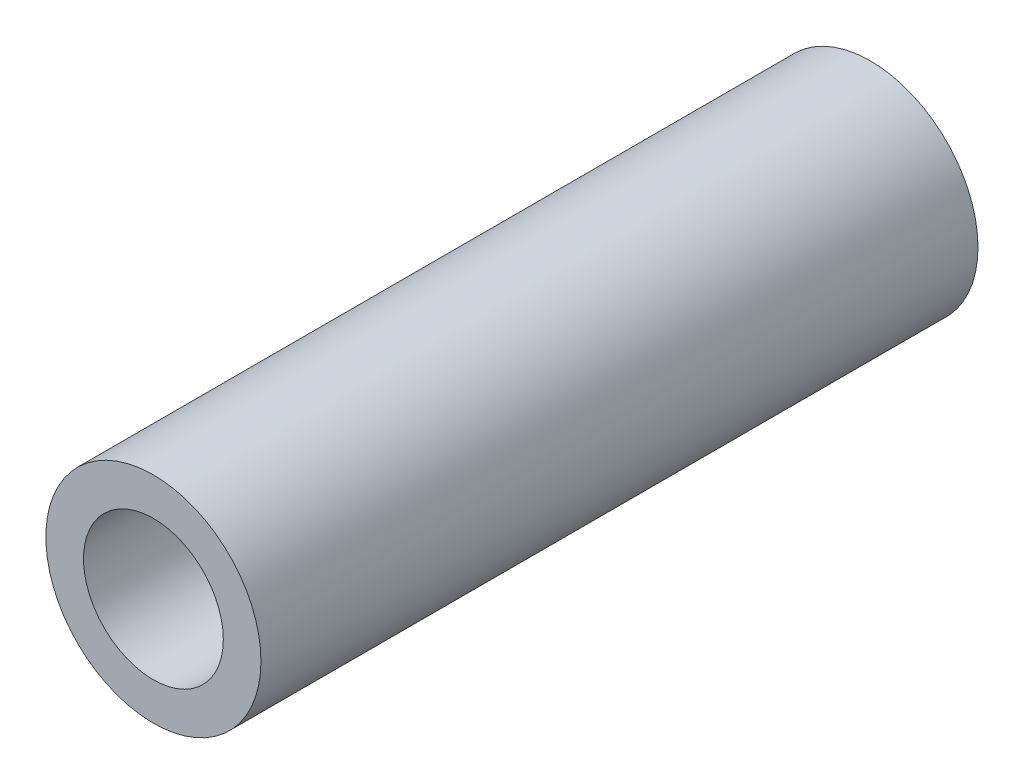
ISO-10303-21;
HEADER;
FILE_DESCRIPTION(('STEP AP214'),'2;1');
FILE_NAME('part.step','',(''),(''),'','','');
FILE_SCHEMA(('AUTOMOTIVE_DESIGN { 1 0 10303 214 1 1 1 1 }'));
ENDSEC;
DATA;
#1=APPLICATION_CONTEXT('core data for automotive mechanical design processes');
#2=APPLICATION_PROTOCOL_DEFINITION('international standard','automotive_design',2000,#1);
#3=PRODUCT_CONTEXT('',#1,'mechanical');
#4=PRODUCT('Part','Part','',(#3));
#5=PRODUCT_RELATED_PRODUCT_CATEGORY('part','',(#4));
#6=PRODUCT_DEFINITION_FORMATION('','',#4);
#7=PRODUCT_DEFINITION_CONTEXT('part definition',#1,'design');
#8=PRODUCT_DEFINITION('design','',#6,#7);
#9=PRODUCT_DEFINITION_SHAPE('','',#8);
#10=(LENGTH_UNIT() NAMED_UNIT(*) SI_UNIT(.MILLI.,.METRE.));
#11=(NAMED_UNIT(*) PLANE_ANGLE_UNIT() SI_UNIT($,.RADIAN.));
#12=(NAMED_UNIT(*) SI_UNIT($,.STERADIAN.) SOLID_ANGLE_UNIT());
#13=UNCERTAINTY_MEASURE_WITH_UNIT(LENGTH_MEASURE(1.E-05),#10,'distance_accuracy_value','');
#14=(GEOMETRIC_REPRESENTATION_CONTEXT(3) GLOBAL_UNCERTAINTY_ASSIGNED_CONTEXT((#13)) GLOBAL_UNIT_ASSIGNED_CONTEXT((#10,
#11,#12)) REPRESENTATION_CONTEXT('',''));
#15=CARTESIAN_POINT('',(0.,0.,0.));
#16=DIRECTION('',(0.,0.,1.));
#17=DIRECTION('',(1.,0.,0.));
#18=AXIS2_PLACEMENT_3D('',#15,#16,#17);
#19=CARTESIAN_POINT('',(0.,0.,20.));
#20=DIRECTION('',(0.,0.,1.));
#21=DIRECTION('',(1.,0.,0.));
#22=AXIS2_PLACEMENT_3D('',#19,#20,#21);
#23=PLANE('',#22);
#24=CARTESIAN_POINT('',(0.,0.,20.));
#25=DIRECTION('',(0.,0.,1.));
#26=DIRECTION('',(1.,0.,0.));
#27=AXIS2_PLACEMENT_3D('',#24,#25,#26);
#28=CIRCLE('',#27,3.);
#29=CARTESIAN_POINT('',(3.,0.,20.));
#30=VERTEX_POINT('',#29);
#31=EDGE_CURVE('E10',#30,#30,#28,.T.);
#32=ORIENTED_EDGE('',*,*,#31,.T.);
#33=EDGE_LOOP('',(#32));
#34=FACE_BOUND('',#33,.T.);
#35=CARTESIAN_POINT('',(0.,0.,20.));
#36=DIRECTION('',(0.,0.,1.));
#37=DIRECTION('',(1.,0.,0.));
#38=AXIS2_PLACEMENT_3D('',#35,#36,#37);
#39=CIRCLE('',#38,1.95);
#40=CARTESIAN_POINT('',(1.95,0.,20.));
#41=VERTEX_POINT('',#40);
#42=EDGE_CURVE('E42',#41,#41,#39,.T.);
#43=ORIENTED_EDGE('',*,*,#42,.F.);
#44=EDGE_LOOP('',(#43));
#45=FACE_BOUND('',#44,.T.);
#46=ADVANCED_FACE('F31',(#34,#45),#23,.T.);
#47=CARTESIAN_POINT('',(0.,0.,0.));
#48=DIRECTION('',(0.,0.,1.));
#49=DIRECTION('',(1.,0.,0.));
#50=AXIS2_PLACEMENT_3D('',#47,#48,#49);
#51=PLANE('',#50);
#52=CARTESIAN_POINT('',(0.,0.,0.));
#53=DIRECTION('',(0.,0.,1.));
#54=DIRECTION('',(1.,0.,0.));
#55=AXIS2_PLACEMENT_3D('',#52,#53,#54);
#56=CIRCLE('',#55,3.);
#57=CARTESIAN_POINT('',(3.,0.,0.));
#58=VERTEX_POINT('',#57);
#59=EDGE_CURVE('E35',#58,#58,#56,.T.);
#60=ORIENTED_EDGE('',*,*,#59,.F.);
#61=EDGE_LOOP('',(#60));
#62=FACE_BOUND('',#61,.T.);
#63=CARTESIAN_POINT('',(0.,0.,0.));
#64=DIRECTION('',(0.,0.,1.));
#65=DIRECTION('',(1.,0.,0.));
#66=AXIS2_PLACEMENT_3D('',#63,#64,#65);
#67=CIRCLE('',#66,1.95);
#68=CARTESIAN_POINT('',(1.95,0.,0.));
#69=VERTEX_POINT('',#68);
#70=EDGE_CURVE('E44',#69,#69,#67,.T.);
#71=ORIENTED_EDGE('',*,*,#70,.T.);
#72=EDGE_LOOP('',(#71));
#73=FACE_BOUND('',#72,.T.);
#74=ADVANCED_FACE('F54',(#62,#73),#51,.F.);
#75=CARTESIAN_POINT('',(0.,0.,20.));
#76=DIRECTION('',(0.,0.,-1.));
#77=DIRECTION('',(-1.,0.,0.));
#78=AXIS2_PLACEMENT_3D('',#75,#76,#77);
#79=CYLINDRICAL_SURFACE('',#78,3.);
#80=ORIENTED_EDGE('',*,*,#31,.F.);
#81=EDGE_LOOP('',(#80));
#82=FACE_BOUND('',#81,.T.);
#83=ORIENTED_EDGE('',*,*,#59,.T.);
#84=EDGE_LOOP('',(#83));
#85=FACE_BOUND('',#84,.T.);
#86=ADVANCED_FACE('F33',(#82,#85),#79,.T.);
#87=CARTESIAN_POINT('',(0.,0.,20.));
#88=DIRECTION('',(0.,0.,-1.));
#89=DIRECTION('',(-1.,0.,0.));
#90=AXIS2_PLACEMENT_3D('',#87,#88,#89);
#91=CYLINDRICAL_SURFACE('',#90,1.95);
#92=ORIENTED_EDGE('',*,*,#42,.T.);
#93=EDGE_LOOP('',(#92));
#94=FACE_BOUND('',#93,.T.);
#95=ORIENTED_EDGE('',*,*,#70,.F.);
#96=EDGE_LOOP('',(#95));
#97=FACE_BOUND('',#96,.T.);
#98=ADVANCED_FACE('F50',(#94,#97),#91,.F.);
#99=CLOSED_SHELL('',(#46,#74,#86,#98));
#100=MANIFOLD_SOLID_BREP('B2',#99);
#101=ADVANCED_BREP_SHAPE_REPRESENTATION('',(#18,#100),#14);
#102=SHAPE_DEFINITION_REPRESENTATION(#9,#101);
ENDSEC;
END-ISO-10303-21;
